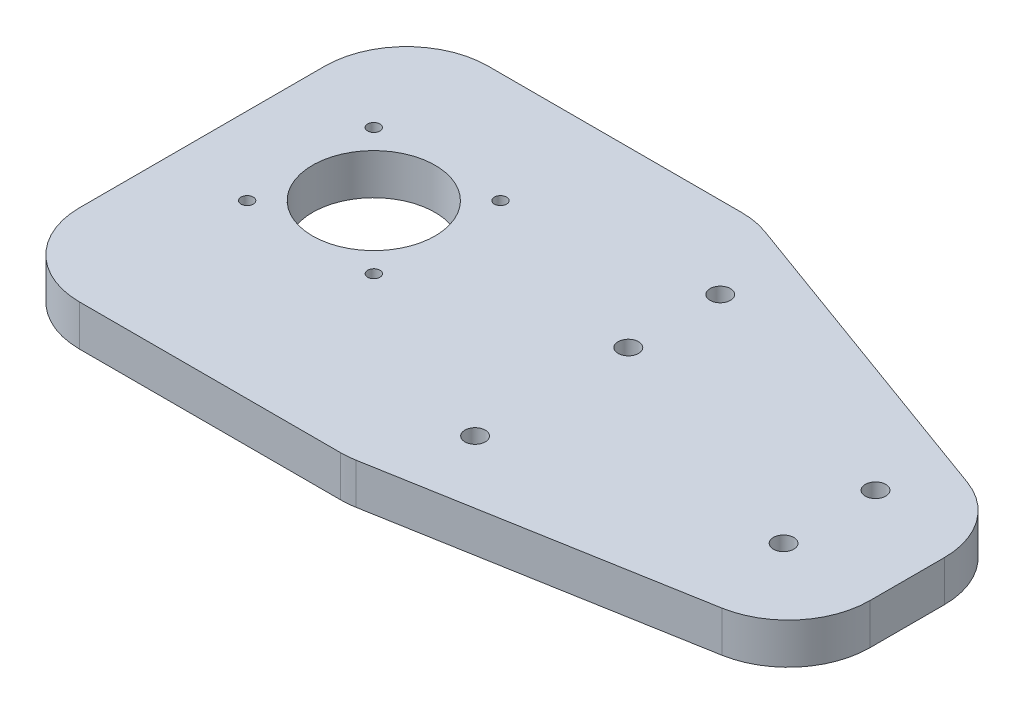
ISO-10303-21;
HEADER;
FILE_DESCRIPTION(('STEP AP214'),'2;1');
FILE_NAME('part.step','',(''),(''),'','','');
FILE_SCHEMA(('AUTOMOTIVE_DESIGN { 1 0 10303 214 1 1 1 1 }'));
ENDSEC;
DATA;
#1=APPLICATION_CONTEXT('core data for automotive mechanical design processes');
#2=APPLICATION_PROTOCOL_DEFINITION('international standard','automotive_design',2000,#1);
#3=PRODUCT_CONTEXT('',#1,'mechanical');
#4=PRODUCT('Part','Part','',(#3));
#5=PRODUCT_RELATED_PRODUCT_CATEGORY('part','',(#4));
#6=PRODUCT_DEFINITION_FORMATION('','',#4);
#7=PRODUCT_DEFINITION_CONTEXT('part definition',#1,'design');
#8=PRODUCT_DEFINITION('design','',#6,#7);
#9=PRODUCT_DEFINITION_SHAPE('','',#8);
#10=(LENGTH_UNIT() NAMED_UNIT(*) SI_UNIT(.MILLI.,.METRE.));
#11=(NAMED_UNIT(*) PLANE_ANGLE_UNIT() SI_UNIT($,.RADIAN.));
#12=(NAMED_UNIT(*) SI_UNIT($,.STERADIAN.) SOLID_ANGLE_UNIT());
#13=UNCERTAINTY_MEASURE_WITH_UNIT(LENGTH_MEASURE(1.E-05),#10,'distance_accuracy_value','');
#14=(GEOMETRIC_REPRESENTATION_CONTEXT(3) GLOBAL_UNCERTAINTY_ASSIGNED_CONTEXT((#13)) GLOBAL_UNIT_ASSIGNED_CONTEXT((#10,
#11,#12)) REPRESENTATION_CONTEXT('',''));
#15=CARTESIAN_POINT('',(0.,0.,0.));
#16=DIRECTION('',(0.,0.,1.));
#17=DIRECTION('',(1.,0.,0.));
#18=AXIS2_PLACEMENT_3D('',#15,#16,#17);
#19=CARTESIAN_POINT('',(20.,10.,-80.));
#20=DIRECTION('',(0.,-1.,0.));
#21=DIRECTION('',(0.,0.,-1.));
#22=AXIS2_PLACEMENT_3D('',#19,#20,#21);
#23=CYLINDRICAL_SURFACE('',#22,20.);
#24=CARTESIAN_POINT('',(20.,0.,-80.));
#25=DIRECTION('',(0.,1.,0.));
#26=DIRECTION('',(0.,0.,1.));
#27=AXIS2_PLACEMENT_3D('',#24,#25,#26);
#28=CIRCLE('',#27,20.);
#29=CARTESIAN_POINT('',(0.,0.,-79.9999999999999));
#30=VERTEX_POINT('',#29);
#31=CARTESIAN_POINT('',(20.0000000000001,0.,-100.));
#32=VERTEX_POINT('',#31);
#33=EDGE_CURVE('E205',#30,#32,#28,.F.);
#34=ORIENTED_EDGE('',*,*,#33,.F.);
#35=DIRECTION('',(0.,-1.,0.));
#36=VECTOR('',#35,1.);
#37=CARTESIAN_POINT('',(0.,10.,-79.9999999999999));
#38=LINE('',#37,#36);
#39=CARTESIAN_POINT('',(0.,10.,-79.9999999999999));
#40=VERTEX_POINT('',#39);
#41=EDGE_CURVE('E11',#40,#30,#38,.T.);
#42=ORIENTED_EDGE('',*,*,#41,.F.);
#43=CARTESIAN_POINT('',(20.,10.,-80.));
#44=DIRECTION('',(0.,1.,0.));
#45=DIRECTION('',(0.,0.,1.));
#46=AXIS2_PLACEMENT_3D('',#43,#44,#45);
#47=CIRCLE('',#46,20.);
#48=CARTESIAN_POINT('',(20.0000000000001,10.,-100.));
#49=VERTEX_POINT('',#48);
#50=EDGE_CURVE('E448',#40,#49,#47,.F.);
#51=ORIENTED_EDGE('',*,*,#50,.T.);
#52=DIRECTION('',(0.,-1.,0.));
#53=VECTOR('',#52,1.);
#54=CARTESIAN_POINT('',(20.0000000000001,10.,-100.));
#55=LINE('',#54,#53);
#56=EDGE_CURVE('E59',#49,#32,#55,.T.);
#57=ORIENTED_EDGE('',*,*,#56,.T.);
#58=EDGE_LOOP('',(#34,#42,#51,#57));
#59=FACE_BOUND('',#58,.T.);
#60=ADVANCED_FACE('F41',(#59),#23,.T.);
#61=CARTESIAN_POINT('',(0.,10.,0.));
#62=DIRECTION('',(-1.,0.,0.));
#63=DIRECTION('',(0.,0.,1.));
#64=AXIS2_PLACEMENT_3D('',#61,#62,#63);
#65=PLANE('',#64);
#66=DIRECTION('',(0.,0.,-1.));
#67=VECTOR('',#66,1.);
#68=CARTESIAN_POINT('',(0.,0.,0.));
#69=LINE('',#68,#67);
#70=CARTESIAN_POINT('',(0.,0.,-20.0000000000001));
#71=VERTEX_POINT('',#70);
#72=EDGE_CURVE('E208',#71,#30,#69,.T.);
#73=ORIENTED_EDGE('',*,*,#72,.F.);
#74=DIRECTION('',(0.,-1.,0.));
#75=VECTOR('',#74,1.);
#76=CARTESIAN_POINT('',(0.,10.,-20.0000000000001));
#77=LINE('',#76,#75);
#78=CARTESIAN_POINT('',(0.,10.,-20.0000000000001));
#79=VERTEX_POINT('',#78);
#80=EDGE_CURVE('E51',#79,#71,#77,.T.);
#81=ORIENTED_EDGE('',*,*,#80,.F.);
#82=DIRECTION('',(0.,0.,-1.));
#83=VECTOR('',#82,1.);
#84=CARTESIAN_POINT('',(0.,10.,0.));
#85=LINE('',#84,#83);
#86=EDGE_CURVE('E321',#79,#40,#85,.T.);
#87=ORIENTED_EDGE('',*,*,#86,.T.);
#88=ORIENTED_EDGE('',*,*,#41,.T.);
#89=EDGE_LOOP('',(#73,#81,#87,#88));
#90=FACE_BOUND('',#89,.T.);
#91=ADVANCED_FACE('F320',(#90),#65,.T.);
#92=CARTESIAN_POINT('',(20.,10.,-20.));
#93=DIRECTION('',(0.,-1.,0.));
#94=DIRECTION('',(0.,0.,-1.));
#95=AXIS2_PLACEMENT_3D('',#92,#93,#94);
#96=CYLINDRICAL_SURFACE('',#95,20.);
#97=CARTESIAN_POINT('',(20.,0.,-20.));
#98=DIRECTION('',(0.,1.,0.));
#99=DIRECTION('',(0.,0.,1.));
#100=AXIS2_PLACEMENT_3D('',#97,#98,#99);
#101=CIRCLE('',#100,20.);
#102=CARTESIAN_POINT('',(20.0000000000001,0.,0.));
#103=VERTEX_POINT('',#102);
#104=EDGE_CURVE('E212',#71,#103,#101,.T.);
#105=ORIENTED_EDGE('',*,*,#104,.T.);
#106=DIRECTION('',(0.,-1.,0.));
#107=VECTOR('',#106,1.);
#108=CARTESIAN_POINT('',(20.0000000000001,10.,0.));
#109=LINE('',#108,#107);
#110=CARTESIAN_POINT('',(20.0000000000001,10.,0.));
#111=VERTEX_POINT('',#110);
#112=EDGE_CURVE('E303',#111,#103,#109,.T.);
#113=ORIENTED_EDGE('',*,*,#112,.F.);
#114=CARTESIAN_POINT('',(20.,10.,-20.));
#115=DIRECTION('',(0.,1.,0.));
#116=DIRECTION('',(0.,0.,1.));
#117=AXIS2_PLACEMENT_3D('',#114,#115,#116);
#118=CIRCLE('',#117,20.);
#119=EDGE_CURVE('E311',#79,#111,#118,.T.);
#120=ORIENTED_EDGE('',*,*,#119,.F.);
#121=ORIENTED_EDGE('',*,*,#80,.T.);
#122=EDGE_LOOP('',(#105,#113,#120,#121));
#123=FACE_BOUND('',#122,.T.);
#124=ADVANCED_FACE('F309',(#123),#96,.T.);
#125=CARTESIAN_POINT('',(0.,10.,0.));
#126=DIRECTION('',(0.,0.,1.));
#127=DIRECTION('',(1.,0.,0.));
#128=AXIS2_PLACEMENT_3D('',#125,#126,#127);
#129=PLANE('',#128);
#130=DIRECTION('',(-1.,0.,0.));
#131=VECTOR('',#130,1.);
#132=CARTESIAN_POINT('',(0.,0.,0.));
#133=LINE('',#132,#131);
#134=CARTESIAN_POINT('',(83.8577357328527,0.,0.));
#135=VERTEX_POINT('',#134);
#136=EDGE_CURVE('E216',#135,#103,#133,.T.);
#137=ORIENTED_EDGE('',*,*,#136,.F.);
#138=DIRECTION('',(0.,-1.,0.));
#139=VECTOR('',#138,1.);
#140=CARTESIAN_POINT('',(83.8577357328527,10.,0.));
#141=LINE('',#140,#139);
#142=CARTESIAN_POINT('',(83.8577357328527,10.,0.));
#143=VERTEX_POINT('',#142);
#144=EDGE_CURVE('E300',#143,#135,#141,.T.);
#145=ORIENTED_EDGE('',*,*,#144,.F.);
#146=DIRECTION('',(-1.,0.,0.));
#147=VECTOR('',#146,1.);
#148=CARTESIAN_POINT('',(0.,10.,0.));
#149=LINE('',#148,#147);
#150=EDGE_CURVE('E457',#143,#111,#149,.T.);
#151=ORIENTED_EDGE('',*,*,#150,.T.);
#152=ORIENTED_EDGE('',*,*,#112,.T.);
#153=EDGE_LOOP('',(#137,#145,#151,#152));
#154=FACE_BOUND('',#153,.T.);
#155=ADVANCED_FACE('F345',(#154),#129,.T.);
#156=CARTESIAN_POINT('',(83.8577357328527,10.,-20.));
#157=DIRECTION('',(0.,-1.,0.));
#158=DIRECTION('',(0.,0.,-1.));
#159=AXIS2_PLACEMENT_3D('',#156,#157,#158);
#160=CYLINDRICAL_SURFACE('',#159,20.);
#161=CARTESIAN_POINT('',(83.8577357328527,0.,-20.));
#162=DIRECTION('',(0.,1.,0.));
#163=DIRECTION('',(0.,0.,1.));
#164=AXIS2_PLACEMENT_3D('',#161,#162,#163);
#165=CIRCLE('',#164,20.);
#166=CARTESIAN_POINT('',(87.3306992861914,0.,-0.303844939755851));
#167=VERTEX_POINT('',#166);
#168=EDGE_CURVE('E220',#167,#135,#165,.F.);
#169=ORIENTED_EDGE('',*,*,#168,.F.);
#170=DIRECTION('',(0.,-1.,0.));
#171=VECTOR('',#170,1.);
#172=CARTESIAN_POINT('',(87.3306992861914,10.,-0.303844939755851));
#173=LINE('',#172,#171);
#174=CARTESIAN_POINT('',(87.3306992861914,10.,-0.303844939755851));
#175=VERTEX_POINT('',#174);
#176=EDGE_CURVE('E297',#175,#167,#173,.T.);
#177=ORIENTED_EDGE('',*,*,#176,.F.);
#178=CARTESIAN_POINT('',(83.8577357328527,10.,-20.));
#179=DIRECTION('',(0.,1.,0.));
#180=DIRECTION('',(0.,0.,1.));
#181=AXIS2_PLACEMENT_3D('',#178,#179,#180);
#182=CIRCLE('',#181,20.);
#183=EDGE_CURVE('E461',#175,#143,#182,.F.);
#184=ORIENTED_EDGE('',*,*,#183,.T.);
#185=ORIENTED_EDGE('',*,*,#144,.T.);
#186=EDGE_LOOP('',(#169,#177,#184,#185));
#187=FACE_BOUND('',#186,.T.);
#188=ADVANCED_FACE('F348',(#187),#160,.T.);
#189=CARTESIAN_POINT('',(2.58138225452005,10.,14.6397462495433));
#190=DIRECTION('',(0.173648177666931,0.,0.984807753012208));
#191=DIRECTION('',(0.984807753012208,0.,-0.173648177666931));
#192=AXIS2_PLACEMENT_3D('',#189,#190,#191);
#193=PLANE('',#192);
#194=DIRECTION('',(-0.984807753012208,0.,0.173648177666931));
#195=VECTOR('',#194,1.);
#196=CARTESIAN_POINT('',(2.58138225452005,0.,14.6397462495433));
#197=LINE('',#196,#195);
#198=CARTESIAN_POINT('',(163.472963553338,0.,-13.729780502288));
#199=VERTEX_POINT('',#198);
#200=EDGE_CURVE('E224',#199,#167,#197,.T.);
#201=ORIENTED_EDGE('',*,*,#200,.F.);
#202=DIRECTION('',(0.,-1.,0.));
#203=VECTOR('',#202,1.);
#204=CARTESIAN_POINT('',(163.472963553338,10.,-13.729780502288));
#205=LINE('',#204,#203);
#206=CARTESIAN_POINT('',(163.472963553338,10.,-13.729780502288));
#207=VERTEX_POINT('',#206);
#208=EDGE_CURVE('E294',#207,#199,#205,.T.);
#209=ORIENTED_EDGE('',*,*,#208,.F.);
#210=DIRECTION('',(-0.984807753012208,0.,0.173648177666931));
#211=VECTOR('',#210,1.);
#212=CARTESIAN_POINT('',(2.58138225452005,10.,14.6397462495433));
#213=LINE('',#212,#211);
#214=EDGE_CURVE('E465',#207,#175,#213,.T.);
#215=ORIENTED_EDGE('',*,*,#214,.T.);
#216=ORIENTED_EDGE('',*,*,#176,.T.);
#217=EDGE_LOOP('',(#201,#209,#215,#216));
#218=FACE_BOUND('',#217,.T.);
#219=ADVANCED_FACE('F352',(#218),#193,.T.);
#220=CARTESIAN_POINT('',(160.,10.,-33.4259355625321));
#221=DIRECTION('',(0.,-1.,0.));
#222=DIRECTION('',(0.,0.,-1.));
#223=AXIS2_PLACEMENT_3D('',#220,#221,#222);
#224=CYLINDRICAL_SURFACE('',#223,20.);
#225=CARTESIAN_POINT('',(160.,0.,-33.4259355625321));
#226=DIRECTION('',(0.,1.,0.));
#227=DIRECTION('',(0.,0.,1.));
#228=AXIS2_PLACEMENT_3D('',#225,#226,#227);
#229=CIRCLE('',#228,20.);
#230=CARTESIAN_POINT('',(180.,0.,-33.4259355625323));
#231=VERTEX_POINT('',#230);
#232=EDGE_CURVE('E228',#231,#199,#229,.F.);
#233=ORIENTED_EDGE('',*,*,#232,.F.);
#234=DIRECTION('',(0.,-1.,0.));
#235=VECTOR('',#234,1.);
#236=CARTESIAN_POINT('',(180.,10.,-33.4259355625323));
#237=LINE('',#236,#235);
#238=CARTESIAN_POINT('',(180.,10.,-33.4259355625323));
#239=VERTEX_POINT('',#238);
#240=EDGE_CURVE('E291',#239,#231,#237,.T.);
#241=ORIENTED_EDGE('',*,*,#240,.F.);
#242=CARTESIAN_POINT('',(160.,10.,-33.4259355625321));
#243=DIRECTION('',(0.,1.,0.));
#244=DIRECTION('',(0.,0.,1.));
#245=AXIS2_PLACEMENT_3D('',#242,#243,#244);
#246=CIRCLE('',#245,20.);
#247=EDGE_CURVE('E469',#239,#207,#246,.F.);
#248=ORIENTED_EDGE('',*,*,#247,.T.);
#249=ORIENTED_EDGE('',*,*,#208,.T.);
#250=EDGE_LOOP('',(#233,#241,#248,#249));
#251=FACE_BOUND('',#250,.T.);
#252=ADVANCED_FACE('F356',(#251),#224,.T.);
#253=CARTESIAN_POINT('',(180.,10.,0.));
#254=DIRECTION('',(1.,0.,0.));
#255=DIRECTION('',(0.,0.,-1.));
#256=AXIS2_PLACEMENT_3D('',#253,#254,#255);
#257=PLANE('',#256);
#258=DIRECTION('',(0.,0.,1.));
#259=VECTOR('',#258,1.);
#260=CARTESIAN_POINT('',(180.,0.,0.));
#261=LINE('',#260,#259);
#262=CARTESIAN_POINT('',(180.,0.,-51.6397921747923));
#263=VERTEX_POINT('',#262);
#264=EDGE_CURVE('E232',#263,#231,#261,.T.);
#265=ORIENTED_EDGE('',*,*,#264,.F.);
#266=DIRECTION('',(0.,-1.,0.));
#267=VECTOR('',#266,1.);
#268=CARTESIAN_POINT('',(180.,10.,-51.6397921747923));
#269=LINE('',#268,#267);
#270=CARTESIAN_POINT('',(180.,10.,-51.6397921747923));
#271=VERTEX_POINT('',#270);
#272=EDGE_CURVE('E288',#271,#263,#269,.T.);
#273=ORIENTED_EDGE('',*,*,#272,.F.);
#274=DIRECTION('',(0.,0.,1.));
#275=VECTOR('',#274,1.);
#276=CARTESIAN_POINT('',(180.,10.,0.));
#277=LINE('',#276,#275);
#278=EDGE_CURVE('E473',#271,#239,#277,.T.);
#279=ORIENTED_EDGE('',*,*,#278,.T.);
#280=ORIENTED_EDGE('',*,*,#240,.T.);
#281=EDGE_LOOP('',(#265,#273,#279,#280));
#282=FACE_BOUND('',#281,.T.);
#283=ADVANCED_FACE('F360',(#282),#257,.T.);
#284=CARTESIAN_POINT('',(160.,10.,-51.6397921747924));
#285=DIRECTION('',(0.,-1.,0.));
#286=DIRECTION('',(0.,0.,-1.));
#287=AXIS2_PLACEMENT_3D('',#284,#285,#286);
#288=CYLINDRICAL_SURFACE('',#287,20.);
#289=CARTESIAN_POINT('',(160.,0.,-51.6397921747924));
#290=DIRECTION('',(0.,1.,0.));
#291=DIRECTION('',(0.,0.,1.));
#292=AXIS2_PLACEMENT_3D('',#289,#290,#291);
#293=CIRCLE('',#292,20.);
#294=CARTESIAN_POINT('',(166.840402866513,0.,-70.4336445905106));
#295=VERTEX_POINT('',#294);
#296=EDGE_CURVE('E236',#295,#263,#293,.F.);
#297=ORIENTED_EDGE('',*,*,#296,.F.);
#298=DIRECTION('',(0.,-1.,0.));
#299=VECTOR('',#298,1.);
#300=CARTESIAN_POINT('',(166.840402866513,10.,-70.4336445905106));
#301=LINE('',#300,#299);
#302=CARTESIAN_POINT('',(166.840402866513,10.,-70.4336445905106));
#303=VERTEX_POINT('',#302);
#304=EDGE_CURVE('E143',#303,#295,#301,.T.);
#305=ORIENTED_EDGE('',*,*,#304,.F.);
#306=CARTESIAN_POINT('',(160.,10.,-51.6397921747924));
#307=DIRECTION('',(0.,1.,0.));
#308=DIRECTION('',(0.,0.,1.));
#309=AXIS2_PLACEMENT_3D('',#306,#307,#308);
#310=CIRCLE('',#309,20.);
#311=EDGE_CURVE('E154',#303,#271,#310,.F.);
#312=ORIENTED_EDGE('',*,*,#311,.T.);
#313=ORIENTED_EDGE('',*,*,#272,.T.);
#314=EDGE_LOOP('',(#297,#305,#312,#313));
#315=FACE_BOUND('',#314,.T.);
#316=ADVANCED_FACE('F364',(#315),#288,.T.);
#317=CARTESIAN_POINT('',(42.1535567053675,10.,-115.815945197697));
#318=DIRECTION('',(0.34202014332567,0.,-0.939692620785908));
#319=DIRECTION('',(-0.939692620785908,0.,-0.34202014332567));
#320=AXIS2_PLACEMENT_3D('',#317,#318,#319);
#321=PLANE('',#320);
#322=DIRECTION('',(0.939692620785908,0.,0.34202014332567));
#323=VECTOR('',#322,1.);
#324=CARTESIAN_POINT('',(42.1535567053675,0.,-115.815945197697));
#325=LINE('',#324,#323);
#326=CARTESIAN_POINT('',(88.9213722557154,0.,-98.7938524157181));
#327=VERTEX_POINT('',#326);
#328=EDGE_CURVE('E138',#327,#295,#325,.T.);
#329=ORIENTED_EDGE('',*,*,#328,.F.);
#330=DIRECTION('',(0.,-1.,0.));
#331=VECTOR('',#330,1.);
#332=CARTESIAN_POINT('',(88.9213722557154,10.,-98.7938524157181));
#333=LINE('',#332,#331);
#334=CARTESIAN_POINT('',(88.9213722557154,10.,-98.7938524157181));
#335=VERTEX_POINT('',#334);
#336=EDGE_CURVE('E133',#335,#327,#333,.T.);
#337=ORIENTED_EDGE('',*,*,#336,.F.);
#338=DIRECTION('',(0.939692620785908,0.,0.34202014332567));
#339=VECTOR('',#338,1.);
#340=CARTESIAN_POINT('',(42.1535567053675,10.,-115.815945197697));
#341=LINE('',#340,#339);
#342=EDGE_CURVE('E136',#335,#303,#341,.T.);
#343=ORIENTED_EDGE('',*,*,#342,.T.);
#344=ORIENTED_EDGE('',*,*,#304,.T.);
#345=EDGE_LOOP('',(#329,#337,#343,#344));
#346=FACE_BOUND('',#345,.T.);
#347=ADVANCED_FACE('F135',(#346),#321,.T.);
#348=CARTESIAN_POINT('',(82.0809693892019,10.,-80.));
#349=DIRECTION('',(0.,-1.,0.));
#350=DIRECTION('',(0.,0.,-1.));
#351=AXIS2_PLACEMENT_3D('',#348,#349,#350);
#352=CYLINDRICAL_SURFACE('',#351,20.);
#353=CARTESIAN_POINT('',(82.0809693892019,0.,-80.));
#354=DIRECTION('',(0.,1.,0.));
#355=DIRECTION('',(0.,0.,1.));
#356=AXIS2_PLACEMENT_3D('',#353,#354,#355);
#357=CIRCLE('',#356,20.);
#358=CARTESIAN_POINT('',(82.0809693892018,0.,-100.));
#359=VERTEX_POINT('',#358);
#360=EDGE_CURVE('E242',#359,#327,#357,.F.);
#361=ORIENTED_EDGE('',*,*,#360,.F.);
#362=DIRECTION('',(0.,-1.,0.));
#363=VECTOR('',#362,1.);
#364=CARTESIAN_POINT('',(82.0809693892018,10.,-100.));
#365=LINE('',#364,#363);
#366=CARTESIAN_POINT('',(82.0809693892018,10.,-100.));
#367=VERTEX_POINT('',#366);
#368=EDGE_CURVE('E96',#367,#359,#365,.T.);
#369=ORIENTED_EDGE('',*,*,#368,.F.);
#370=CARTESIAN_POINT('',(82.0809693892019,10.,-80.));
#371=DIRECTION('',(0.,1.,0.));
#372=DIRECTION('',(0.,0.,1.));
#373=AXIS2_PLACEMENT_3D('',#370,#371,#372);
#374=CIRCLE('',#373,20.);
#375=EDGE_CURVE('E151',#367,#335,#374,.F.);
#376=ORIENTED_EDGE('',*,*,#375,.T.);
#377=ORIENTED_EDGE('',*,*,#336,.T.);
#378=EDGE_LOOP('',(#361,#369,#376,#377));
#379=FACE_BOUND('',#378,.T.);
#380=ADVANCED_FACE('F157',(#379),#352,.T.);
#381=CARTESIAN_POINT('',(34.5,10.,-57.5));
#382=DIRECTION('',(0.,-1.,0.));
#383=DIRECTION('',(0.,0.,-1.));
#384=AXIS2_PLACEMENT_3D('',#381,#382,#383);
#385=CYLINDRICAL_SURFACE('',#384,15.);
#386=CARTESIAN_POINT('',(34.5,10.,-57.5));
#387=DIRECTION('',(0.,1.,0.));
#388=DIRECTION('',(0.,0.,1.));
#389=AXIS2_PLACEMENT_3D('',#386,#387,#388);
#390=CIRCLE('',#389,15.);
#391=CARTESIAN_POINT('',(34.5,10.,-42.5));
#392=VERTEX_POINT('',#391);
#393=EDGE_CURVE('E189',#392,#392,#390,.T.);
#394=ORIENTED_EDGE('',*,*,#393,.T.);
#395=EDGE_LOOP('',(#394));
#396=FACE_BOUND('',#395,.T.);
#397=CARTESIAN_POINT('',(34.5,0.,-57.5));
#398=DIRECTION('',(0.,1.,0.));
#399=DIRECTION('',(0.,0.,1.));
#400=AXIS2_PLACEMENT_3D('',#397,#398,#399);
#401=CIRCLE('',#400,15.);
#402=CARTESIAN_POINT('',(34.5,0.,-42.5));
#403=VERTEX_POINT('',#402);
#404=EDGE_CURVE('E273',#403,#403,#401,.T.);
#405=ORIENTED_EDGE('',*,*,#404,.F.);
#406=EDGE_LOOP('',(#405));
#407=FACE_BOUND('',#406,.T.);
#408=ADVANCED_FACE('F371',(#396,#407),#385,.F.);
#409=CARTESIAN_POINT('',(19.,10.,-73.));
#410=DIRECTION('',(0.,-1.,0.));
#411=DIRECTION('',(0.,0.,-1.));
#412=AXIS2_PLACEMENT_3D('',#409,#410,#411);
#413=CYLINDRICAL_SURFACE('',#412,1.5);
#414=CARTESIAN_POINT('',(19.,10.,-73.));
#415=DIRECTION('',(0.,1.,0.));
#416=DIRECTION('',(0.,0.,1.));
#417=AXIS2_PLACEMENT_3D('',#414,#415,#416);
#418=CIRCLE('',#417,1.5);
#419=CARTESIAN_POINT('',(19.,10.,-71.5));
#420=VERTEX_POINT('',#419);
#421=EDGE_CURVE('E185',#420,#420,#418,.T.);
#422=ORIENTED_EDGE('',*,*,#421,.T.);
#423=EDGE_LOOP('',(#422));
#424=FACE_BOUND('',#423,.T.);
#425=CARTESIAN_POINT('',(19.,0.,-73.));
#426=DIRECTION('',(0.,1.,0.));
#427=DIRECTION('',(0.,0.,1.));
#428=AXIS2_PLACEMENT_3D('',#425,#426,#427);
#429=CIRCLE('',#428,1.5);
#430=CARTESIAN_POINT('',(19.,0.,-71.5));
#431=VERTEX_POINT('',#430);
#432=EDGE_CURVE('E269',#431,#431,#429,.T.);
#433=ORIENTED_EDGE('',*,*,#432,.F.);
#434=EDGE_LOOP('',(#433));
#435=FACE_BOUND('',#434,.T.);
#436=ADVANCED_FACE('F375',(#424,#435),#413,.F.);
#437=CARTESIAN_POINT('',(50.,10.,-73.));
#438=DIRECTION('',(0.,-1.,0.));
#439=DIRECTION('',(0.,0.,-1.));
#440=AXIS2_PLACEMENT_3D('',#437,#438,#439);
#441=CYLINDRICAL_SURFACE('',#440,1.5);
#442=CARTESIAN_POINT('',(50.,10.,-73.));
#443=DIRECTION('',(0.,1.,0.));
#444=DIRECTION('',(0.,0.,1.));
#445=AXIS2_PLACEMENT_3D('',#442,#443,#444);
#446=CIRCLE('',#445,1.5);
#447=CARTESIAN_POINT('',(50.,10.,-71.5));
#448=VERTEX_POINT('',#447);
#449=EDGE_CURVE('E181',#448,#448,#446,.F.);
#450=ORIENTED_EDGE('',*,*,#449,.F.);
#451=EDGE_LOOP('',(#450));
#452=FACE_BOUND('',#451,.T.);
#453=CARTESIAN_POINT('',(50.,0.,-73.));
#454=DIRECTION('',(0.,1.,0.));
#455=DIRECTION('',(0.,0.,1.));
#456=AXIS2_PLACEMENT_3D('',#453,#454,#455);
#457=CIRCLE('',#456,1.5);
#458=CARTESIAN_POINT('',(50.,0.,-71.5));
#459=VERTEX_POINT('',#458);
#460=EDGE_CURVE('E265',#459,#459,#457,.F.);
#461=ORIENTED_EDGE('',*,*,#460,.T.);
#462=EDGE_LOOP('',(#461));
#463=FACE_BOUND('',#462,.T.);
#464=ADVANCED_FACE('F381',(#452,#463),#441,.F.);
#465=CARTESIAN_POINT('',(50.,10.,-42.));
#466=DIRECTION('',(0.,-1.,0.));
#467=DIRECTION('',(0.,0.,-1.));
#468=AXIS2_PLACEMENT_3D('',#465,#466,#467);
#469=CYLINDRICAL_SURFACE('',#468,1.5);
#470=CARTESIAN_POINT('',(50.,10.,-42.));
#471=DIRECTION('',(0.,1.,0.));
#472=DIRECTION('',(0.,0.,1.));
#473=AXIS2_PLACEMENT_3D('',#470,#471,#472);
#474=CIRCLE('',#473,1.5);
#475=CARTESIAN_POINT('',(50.,10.,-40.5));
#476=VERTEX_POINT('',#475);
#477=EDGE_CURVE('E177',#476,#476,#474,.T.);
#478=ORIENTED_EDGE('',*,*,#477,.T.);
#479=EDGE_LOOP('',(#478));
#480=FACE_BOUND('',#479,.T.);
#481=CARTESIAN_POINT('',(50.,0.,-42.));
#482=DIRECTION('',(0.,1.,0.));
#483=DIRECTION('',(0.,0.,1.));
#484=AXIS2_PLACEMENT_3D('',#481,#482,#483);
#485=CIRCLE('',#484,1.5);
#486=CARTESIAN_POINT('',(50.,0.,-40.5));
#487=VERTEX_POINT('',#486);
#488=EDGE_CURVE('E261',#487,#487,#485,.T.);
#489=ORIENTED_EDGE('',*,*,#488,.F.);
#490=EDGE_LOOP('',(#489));
#491=FACE_BOUND('',#490,.T.);
#492=ADVANCED_FACE('F391',(#480,#491),#469,.F.);
#493=CARTESIAN_POINT('',(96.8,10.,-80.));
#494=DIRECTION('',(0.,-1.,0.));
#495=DIRECTION('',(0.,0.,-1.));
#496=AXIS2_PLACEMENT_3D('',#493,#494,#495);
#497=CYLINDRICAL_SURFACE('',#496,2.5);
#498=CARTESIAN_POINT('',(96.8,10.,-80.));
#499=DIRECTION('',(0.,1.,0.));
#500=DIRECTION('',(0.,0.,1.));
#501=AXIS2_PLACEMENT_3D('',#498,#499,#500);
#502=CIRCLE('',#501,2.5);
#503=CARTESIAN_POINT('',(96.8,10.,-77.5));
#504=VERTEX_POINT('',#503);
#505=EDGE_CURVE('E173',#504,#504,#502,.T.);
#506=ORIENTED_EDGE('',*,*,#505,.T.);
#507=EDGE_LOOP('',(#506));
#508=FACE_BOUND('',#507,.T.);
#509=CARTESIAN_POINT('',(96.8,0.,-80.));
#510=DIRECTION('',(0.,1.,0.));
#511=DIRECTION('',(0.,0.,1.));
#512=AXIS2_PLACEMENT_3D('',#509,#510,#511);
#513=CIRCLE('',#512,2.5);
#514=CARTESIAN_POINT('',(96.8,0.,-77.5));
#515=VERTEX_POINT('',#514);
#516=EDGE_CURVE('E257',#515,#515,#513,.T.);
#517=ORIENTED_EDGE('',*,*,#516,.F.);
#518=EDGE_LOOP('',(#517));
#519=FACE_BOUND('',#518,.T.);
#520=ADVANCED_FACE('F395',(#508,#519),#497,.F.);
#521=CARTESIAN_POINT('',(96.8,10.,-20.));
#522=DIRECTION('',(0.,-1.,0.));
#523=DIRECTION('',(0.,0.,-1.));
#524=AXIS2_PLACEMENT_3D('',#521,#522,#523);
#525=CYLINDRICAL_SURFACE('',#524,2.5);
#526=CARTESIAN_POINT('',(96.8,10.,-20.));
#527=DIRECTION('',(0.,1.,0.));
#528=DIRECTION('',(0.,0.,1.));
#529=AXIS2_PLACEMENT_3D('',#526,#527,#528);
#530=CIRCLE('',#529,2.5);
#531=CARTESIAN_POINT('',(96.8,10.,-17.5));
#532=VERTEX_POINT('',#531);
#533=EDGE_CURVE('E169',#532,#532,#530,.T.);
#534=ORIENTED_EDGE('',*,*,#533,.T.);
#535=EDGE_LOOP('',(#534));
#536=FACE_BOUND('',#535,.T.);
#537=CARTESIAN_POINT('',(96.8,0.,-20.));
#538=DIRECTION('',(0.,1.,0.));
#539=DIRECTION('',(0.,0.,1.));
#540=AXIS2_PLACEMENT_3D('',#537,#538,#539);
#541=CIRCLE('',#540,2.5);
#542=CARTESIAN_POINT('',(96.8,0.,-17.5));
#543=VERTEX_POINT('',#542);
#544=EDGE_CURVE('E253',#543,#543,#541,.T.);
#545=ORIENTED_EDGE('',*,*,#544,.F.);
#546=EDGE_LOOP('',(#545));
#547=FACE_BOUND('',#546,.T.);
#548=ADVANCED_FACE('F332',(#536,#547),#525,.F.);
#549=CARTESIAN_POINT('',(157.3,10.,-35.));
#550=DIRECTION('',(0.,-1.,0.));
#551=DIRECTION('',(0.,0.,-1.));
#552=AXIS2_PLACEMENT_3D('',#549,#550,#551);
#553=CYLINDRICAL_SURFACE('',#552,2.5);
#554=CARTESIAN_POINT('',(157.3,10.,-35.));
#555=DIRECTION('',(0.,1.,0.));
#556=DIRECTION('',(0.,0.,1.));
#557=AXIS2_PLACEMENT_3D('',#554,#555,#556);
#558=CIRCLE('',#557,2.5);
#559=CARTESIAN_POINT('',(157.3,10.,-32.5));
#560=VERTEX_POINT('',#559);
#561=EDGE_CURVE('E162',#560,#560,#558,.T.);
#562=ORIENTED_EDGE('',*,*,#561,.T.);
#563=EDGE_LOOP('',(#562));
#564=FACE_BOUND('',#563,.T.);
#565=CARTESIAN_POINT('',(157.3,0.,-35.));
#566=DIRECTION('',(0.,1.,0.));
#567=DIRECTION('',(0.,0.,1.));
#568=AXIS2_PLACEMENT_3D('',#565,#566,#567);
#569=CIRCLE('',#568,2.5);
#570=CARTESIAN_POINT('',(157.3,0.,-32.5));
#571=VERTEX_POINT('',#570);
#572=EDGE_CURVE('E249',#571,#571,#569,.T.);
#573=ORIENTED_EDGE('',*,*,#572,.F.);
#574=EDGE_LOOP('',(#573));
#575=FACE_BOUND('',#574,.T.);
#576=ADVANCED_FACE('F325',(#564,#575),#553,.F.);
#577=CARTESIAN_POINT('',(0.,10.,-100.));
#578=DIRECTION('',(0.,0.,-1.));
#579=DIRECTION('',(-1.,0.,0.));
#580=AXIS2_PLACEMENT_3D('',#577,#578,#579);
#581=PLANE('',#580);
#582=DIRECTION('',(1.,0.,0.));
#583=VECTOR('',#582,1.);
#584=CARTESIAN_POINT('',(0.,0.,-100.));
#585=LINE('',#584,#583);
#586=EDGE_CURVE('E245',#32,#359,#585,.T.);
#587=ORIENTED_EDGE('',*,*,#586,.F.);
#588=ORIENTED_EDGE('',*,*,#56,.F.);
#589=DIRECTION('',(1.,0.,0.));
#590=VECTOR('',#589,1.);
#591=CARTESIAN_POINT('',(0.,10.,-100.));
#592=LINE('',#591,#590);
#593=EDGE_CURVE('E159',#49,#367,#592,.T.);
#594=ORIENTED_EDGE('',*,*,#593,.T.);
#595=ORIENTED_EDGE('',*,*,#368,.T.);
#596=EDGE_LOOP('',(#587,#588,#594,#595));
#597=FACE_BOUND('',#596,.T.);
#598=ADVANCED_FACE('F322',(#597),#581,.T.);
#599=CARTESIAN_POINT('',(96.8,10.,-57.5));
#600=DIRECTION('',(0.,-1.,0.));
#601=DIRECTION('',(0.,0.,-1.));
#602=AXIS2_PLACEMENT_3D('',#599,#600,#601);
#603=CYLINDRICAL_SURFACE('',#602,2.50000000000001);
#604=CARTESIAN_POINT('',(96.8,10.,-57.5));
#605=DIRECTION('',(0.,1.,0.));
#606=DIRECTION('',(0.,0.,1.));
#607=AXIS2_PLACEMENT_3D('',#604,#605,#606);
#608=CIRCLE('',#607,2.50000000000001);
#609=CARTESIAN_POINT('',(96.8,10.,-55.));
#610=VERTEX_POINT('',#609);
#611=EDGE_CURVE('E444',#610,#610,#608,.T.);
#612=ORIENTED_EDGE('',*,*,#611,.T.);
#613=EDGE_LOOP('',(#612));
#614=FACE_BOUND('',#613,.T.);
#615=CARTESIAN_POINT('',(96.8,0.,-57.5));
#616=DIRECTION('',(0.,1.,0.));
#617=DIRECTION('',(0.,0.,1.));
#618=AXIS2_PLACEMENT_3D('',#615,#616,#617);
#619=CIRCLE('',#618,2.50000000000001);
#620=CARTESIAN_POINT('',(96.8,0.,-55.));
#621=VERTEX_POINT('',#620);
#622=EDGE_CURVE('E201',#621,#621,#619,.T.);
#623=ORIENTED_EDGE('',*,*,#622,.F.);
#624=EDGE_LOOP('',(#623));
#625=FACE_BOUND('',#624,.T.);
#626=ADVANCED_FACE('F324',(#614,#625),#603,.F.);
#627=CARTESIAN_POINT('',(157.3,10.,-57.5));
#628=DIRECTION('',(0.,-1.,0.));
#629=DIRECTION('',(0.,0.,-1.));
#630=AXIS2_PLACEMENT_3D('',#627,#628,#629);
#631=CYLINDRICAL_SURFACE('',#630,2.5);
#632=CARTESIAN_POINT('',(157.3,10.,-57.5));
#633=DIRECTION('',(0.,1.,0.));
#634=DIRECTION('',(0.,0.,1.));
#635=AXIS2_PLACEMENT_3D('',#632,#633,#634);
#636=CIRCLE('',#635,2.5);
#637=CARTESIAN_POINT('',(157.3,10.,-55.));
#638=VERTEX_POINT('',#637);
#639=EDGE_CURVE('E281',#638,#638,#636,.T.);
#640=ORIENTED_EDGE('',*,*,#639,.T.);
#641=EDGE_LOOP('',(#640));
#642=FACE_BOUND('',#641,.T.);
#643=CARTESIAN_POINT('',(157.3,0.,-57.5));
#644=DIRECTION('',(0.,1.,0.));
#645=DIRECTION('',(0.,0.,1.));
#646=AXIS2_PLACEMENT_3D('',#643,#644,#645);
#647=CIRCLE('',#646,2.5);
#648=CARTESIAN_POINT('',(157.3,0.,-55.));
#649=VERTEX_POINT('',#648);
#650=EDGE_CURVE('E197',#649,#649,#647,.T.);
#651=ORIENTED_EDGE('',*,*,#650,.F.);
#652=EDGE_LOOP('',(#651));
#653=FACE_BOUND('',#652,.T.);
#654=ADVANCED_FACE('F43',(#642,#653),#631,.F.);
#655=CARTESIAN_POINT('',(19.,10.,-42.));
#656=DIRECTION('',(0.,-1.,0.));
#657=DIRECTION('',(0.,0.,-1.));
#658=AXIS2_PLACEMENT_3D('',#655,#656,#657);
#659=CYLINDRICAL_SURFACE('',#658,1.5);
#660=CARTESIAN_POINT('',(19.,10.,-42.));
#661=DIRECTION('',(0.,1.,0.));
#662=DIRECTION('',(0.,0.,1.));
#663=AXIS2_PLACEMENT_3D('',#660,#661,#662);
#664=CIRCLE('',#663,1.5);
#665=CARTESIAN_POINT('',(19.,10.,-40.5));
#666=VERTEX_POINT('',#665);
#667=EDGE_CURVE('E193',#666,#666,#664,.F.);
#668=ORIENTED_EDGE('',*,*,#667,.F.);
#669=EDGE_LOOP('',(#668));
#670=FACE_BOUND('',#669,.T.);
#671=CARTESIAN_POINT('',(19.,0.,-42.));
#672=DIRECTION('',(0.,1.,0.));
#673=DIRECTION('',(0.,0.,1.));
#674=AXIS2_PLACEMENT_3D('',#671,#672,#673);
#675=CIRCLE('',#674,1.5);
#676=CARTESIAN_POINT('',(19.,0.,-40.5));
#677=VERTEX_POINT('',#676);
#678=EDGE_CURVE('E277',#677,#677,#675,.F.);
#679=ORIENTED_EDGE('',*,*,#678,.T.);
#680=EDGE_LOOP('',(#679));
#681=FACE_BOUND('',#680,.T.);
#682=ADVANCED_FACE('F386',(#670,#681),#659,.F.);
#683=CARTESIAN_POINT('',(0.,10.,0.));
#684=DIRECTION('',(0.,1.,0.));
#685=DIRECTION('',(0.,0.,1.));
#686=AXIS2_PLACEMENT_3D('',#683,#684,#685);
#687=PLANE('',#686);
#688=ORIENTED_EDGE('',*,*,#639,.F.);
#689=EDGE_LOOP('',(#688));
#690=FACE_BOUND('',#689,.T.);
#691=ORIENTED_EDGE('',*,*,#611,.F.);
#692=EDGE_LOOP('',(#691));
#693=FACE_BOUND('',#692,.T.);
#694=ORIENTED_EDGE('',*,*,#50,.F.);
#695=ORIENTED_EDGE('',*,*,#86,.F.);
#696=ORIENTED_EDGE('',*,*,#119,.T.);
#697=ORIENTED_EDGE('',*,*,#150,.F.);
#698=ORIENTED_EDGE('',*,*,#183,.F.);
#699=ORIENTED_EDGE('',*,*,#214,.F.);
#700=ORIENTED_EDGE('',*,*,#247,.F.);
#701=ORIENTED_EDGE('',*,*,#278,.F.);
#702=ORIENTED_EDGE('',*,*,#311,.F.);
#703=ORIENTED_EDGE('',*,*,#342,.F.);
#704=ORIENTED_EDGE('',*,*,#375,.F.);
#705=ORIENTED_EDGE('',*,*,#593,.F.);
#706=EDGE_LOOP('',(#694,#695,#696,#697,#698,#699,#700,#701,#702,#703,#704,#705));
#707=FACE_BOUND('',#706,.T.);
#708=ORIENTED_EDGE('',*,*,#561,.F.);
#709=EDGE_LOOP('',(#708));
#710=FACE_BOUND('',#709,.T.);
#711=ORIENTED_EDGE('',*,*,#533,.F.);
#712=EDGE_LOOP('',(#711));
#713=FACE_BOUND('',#712,.T.);
#714=ORIENTED_EDGE('',*,*,#505,.F.);
#715=EDGE_LOOP('',(#714));
#716=FACE_BOUND('',#715,.T.);
#717=ORIENTED_EDGE('',*,*,#477,.F.);
#718=EDGE_LOOP('',(#717));
#719=FACE_BOUND('',#718,.T.);
#720=ORIENTED_EDGE('',*,*,#449,.T.);
#721=EDGE_LOOP('',(#720));
#722=FACE_BOUND('',#721,.T.);
#723=ORIENTED_EDGE('',*,*,#421,.F.);
#724=EDGE_LOOP('',(#723));
#725=FACE_BOUND('',#724,.T.);
#726=ORIENTED_EDGE('',*,*,#393,.F.);
#727=EDGE_LOOP('',(#726));
#728=FACE_BOUND('',#727,.T.);
#729=ORIENTED_EDGE('',*,*,#667,.T.);
#730=EDGE_LOOP('',(#729));
#731=FACE_BOUND('',#730,.T.);
#732=ADVANCED_FACE('F148',(#690,#693,#707,#710,#713,#716,#719,#722,#725,#728,#731),#687,.T.);
#733=CARTESIAN_POINT('',(0.,0.,0.));
#734=DIRECTION('',(0.,1.,0.));
#735=DIRECTION('',(0.,0.,1.));
#736=AXIS2_PLACEMENT_3D('',#733,#734,#735);
#737=PLANE('',#736);
#738=ORIENTED_EDGE('',*,*,#650,.T.);
#739=EDGE_LOOP('',(#738));
#740=FACE_BOUND('',#739,.T.);
#741=ORIENTED_EDGE('',*,*,#622,.T.);
#742=EDGE_LOOP('',(#741));
#743=FACE_BOUND('',#742,.T.);
#744=ORIENTED_EDGE('',*,*,#33,.T.);
#745=ORIENTED_EDGE('',*,*,#586,.T.);
#746=ORIENTED_EDGE('',*,*,#360,.T.);
#747=ORIENTED_EDGE('',*,*,#328,.T.);
#748=ORIENTED_EDGE('',*,*,#296,.T.);
#749=ORIENTED_EDGE('',*,*,#264,.T.);
#750=ORIENTED_EDGE('',*,*,#232,.T.);
#751=ORIENTED_EDGE('',*,*,#200,.T.);
#752=ORIENTED_EDGE('',*,*,#168,.T.);
#753=ORIENTED_EDGE('',*,*,#136,.T.);
#754=ORIENTED_EDGE('',*,*,#104,.F.);
#755=ORIENTED_EDGE('',*,*,#72,.T.);
#756=EDGE_LOOP('',(#744,#745,#746,#747,#748,#749,#750,#751,#752,#753,#754,#755));
#757=FACE_BOUND('',#756,.T.);
#758=ORIENTED_EDGE('',*,*,#572,.T.);
#759=EDGE_LOOP('',(#758));
#760=FACE_BOUND('',#759,.T.);
#761=ORIENTED_EDGE('',*,*,#544,.T.);
#762=EDGE_LOOP('',(#761));
#763=FACE_BOUND('',#762,.T.);
#764=ORIENTED_EDGE('',*,*,#516,.T.);
#765=EDGE_LOOP('',(#764));
#766=FACE_BOUND('',#765,.T.);
#767=ORIENTED_EDGE('',*,*,#488,.T.);
#768=EDGE_LOOP('',(#767));
#769=FACE_BOUND('',#768,.T.);
#770=ORIENTED_EDGE('',*,*,#460,.F.);
#771=EDGE_LOOP('',(#770));
#772=FACE_BOUND('',#771,.T.);
#773=ORIENTED_EDGE('',*,*,#432,.T.);
#774=EDGE_LOOP('',(#773));
#775=FACE_BOUND('',#774,.T.);
#776=ORIENTED_EDGE('',*,*,#404,.T.);
#777=EDGE_LOOP('',(#776));
#778=FACE_BOUND('',#777,.T.);
#779=ORIENTED_EDGE('',*,*,#678,.F.);
#780=EDGE_LOOP('',(#779));
#781=FACE_BOUND('',#780,.T.);
#782=ADVANCED_FACE('F317',(#740,#743,#757,#760,#763,#766,#769,#772,#775,#778,#781),#737,.F.);
#783=CLOSED_SHELL('',(#60,#91,#124,#155,#188,#219,#252,#283,#316,#347,#380,#408,#436,#464,#492,
#520,#548,#576,#598,#626,#654,#682,#732,#782));
#784=MANIFOLD_SOLID_BREP('B2',#783);
#785=ADVANCED_BREP_SHAPE_REPRESENTATION('',(#18,#784),#14);
#786=SHAPE_DEFINITION_REPRESENTATION(#9,#785);
ENDSEC;
END-ISO-10303-21;
